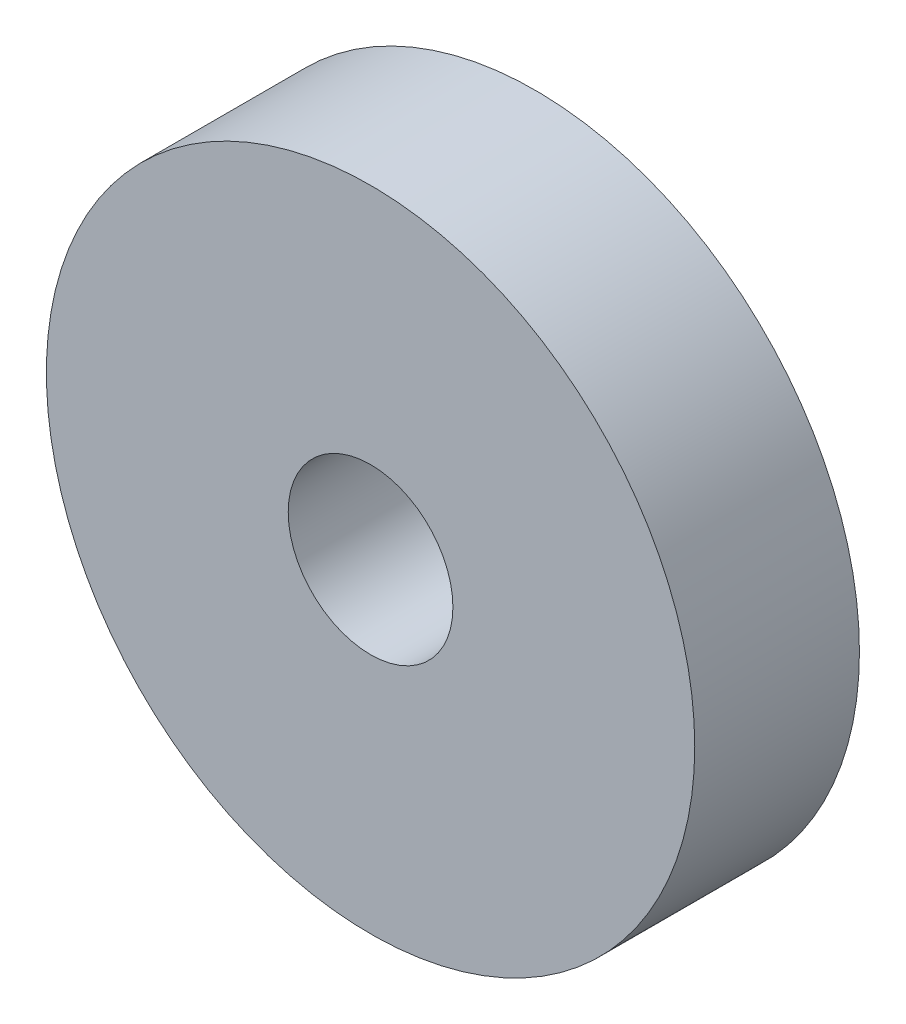
ISO-10303-21;
HEADER;
FILE_DESCRIPTION(('STEP AP214'),'2;1');
FILE_NAME('part.step','',(''),(''),'','','');
FILE_SCHEMA(('AUTOMOTIVE_DESIGN { 1 0 10303 214 1 1 1 1 }'));
ENDSEC;
DATA;
#1=APPLICATION_CONTEXT('core data for automotive mechanical design processes');
#2=APPLICATION_PROTOCOL_DEFINITION('international standard','automotive_design',2000,#1);
#3=PRODUCT_CONTEXT('',#1,'mechanical');
#4=PRODUCT('Part','Part','',(#3));
#5=PRODUCT_RELATED_PRODUCT_CATEGORY('part','',(#4));
#6=PRODUCT_DEFINITION_FORMATION('','',#4);
#7=PRODUCT_DEFINITION_CONTEXT('part definition',#1,'design');
#8=PRODUCT_DEFINITION('design','',#6,#7);
#9=PRODUCT_DEFINITION_SHAPE('','',#8);
#10=(LENGTH_UNIT() NAMED_UNIT(*) SI_UNIT(.MILLI.,.METRE.));
#11=(NAMED_UNIT(*) PLANE_ANGLE_UNIT() SI_UNIT($,.RADIAN.));
#12=(NAMED_UNIT(*) SI_UNIT($,.STERADIAN.) SOLID_ANGLE_UNIT());
#13=UNCERTAINTY_MEASURE_WITH_UNIT(LENGTH_MEASURE(1.E-05),#10,'distance_accuracy_value','');
#14=(GEOMETRIC_REPRESENTATION_CONTEXT(3) GLOBAL_UNCERTAINTY_ASSIGNED_CONTEXT((#13)) GLOBAL_UNIT_ASSIGNED_CONTEXT((#10,
#11,#12)) REPRESENTATION_CONTEXT('',''));
#15=CARTESIAN_POINT('',(0.,0.,0.));
#16=DIRECTION('',(0.,0.,1.));
#17=DIRECTION('',(1.,0.,0.));
#18=AXIS2_PLACEMENT_3D('',#15,#16,#17);
#19=CARTESIAN_POINT('',(0.,0.,6.35));
#20=DIRECTION('',(0.,0.,-1.));
#21=DIRECTION('',(-1.,0.,0.));
#22=AXIS2_PLACEMENT_3D('',#19,#20,#21);
#23=CYLINDRICAL_SURFACE('',#22,12.5);
#24=CARTESIAN_POINT('',(0.,0.,6.35));
#25=DIRECTION('',(0.,0.,1.));
#26=DIRECTION('',(1.,0.,0.));
#27=AXIS2_PLACEMENT_3D('',#24,#25,#26);
#28=CIRCLE('',#27,12.5);
#29=CARTESIAN_POINT('',(12.5,0.,6.35));
#30=VERTEX_POINT('',#29);
#31=EDGE_CURVE('E10',#30,#30,#28,.T.);
#32=ORIENTED_EDGE('',*,*,#31,.F.);
#33=EDGE_LOOP('',(#32));
#34=FACE_BOUND('',#33,.T.);
#35=CARTESIAN_POINT('',(0.,0.,0.));
#36=DIRECTION('',(0.,0.,1.));
#37=DIRECTION('',(1.,0.,0.));
#38=AXIS2_PLACEMENT_3D('',#35,#36,#37);
#39=CIRCLE('',#38,12.5);
#40=CARTESIAN_POINT('',(12.5,0.,0.));
#41=VERTEX_POINT('',#40);
#42=EDGE_CURVE('E38',#41,#41,#39,.T.);
#43=ORIENTED_EDGE('',*,*,#42,.T.);
#44=EDGE_LOOP('',(#43));
#45=FACE_BOUND('',#44,.T.);
#46=ADVANCED_FACE('F31',(#34,#45),#23,.T.);
#47=CARTESIAN_POINT('',(0.,0.,6.35));
#48=DIRECTION('',(0.,0.,1.));
#49=DIRECTION('',(1.,0.,0.));
#50=AXIS2_PLACEMENT_3D('',#47,#48,#49);
#51=PLANE('',#50);
#52=CARTESIAN_POINT('',(0.,0.,6.35));
#53=DIRECTION('',(0.,0.,1.));
#54=DIRECTION('',(1.,0.,0.));
#55=AXIS2_PLACEMENT_3D('',#52,#53,#54);
#56=CIRCLE('',#55,3.17499999999999);
#57=CARTESIAN_POINT('',(3.17499999999999,0.,6.35));
#58=VERTEX_POINT('',#57);
#59=EDGE_CURVE('E34',#58,#58,#56,.T.);
#60=ORIENTED_EDGE('',*,*,#59,.F.);
#61=EDGE_LOOP('',(#60));
#62=FACE_BOUND('',#61,.T.);
#63=ORIENTED_EDGE('',*,*,#31,.T.);
#64=EDGE_LOOP('',(#63));
#65=FACE_BOUND('',#64,.T.);
#66=ADVANCED_FACE('F53',(#62,#65),#51,.T.);
#67=CARTESIAN_POINT('',(0.,0.,0.));
#68=DIRECTION('',(0.,0.,1.));
#69=DIRECTION('',(1.,0.,0.));
#70=AXIS2_PLACEMENT_3D('',#67,#68,#69);
#71=PLANE('',#70);
#72=CARTESIAN_POINT('',(0.,0.,0.));
#73=DIRECTION('',(0.,0.,-1.));
#74=DIRECTION('',(-1.,0.,0.));
#75=AXIS2_PLACEMENT_3D('',#72,#73,#74);
#76=CIRCLE('',#75,3.17499999999999);
#77=CARTESIAN_POINT('',(-3.17499999999999,0.,0.));
#78=VERTEX_POINT('',#77);
#79=EDGE_CURVE('E44',#78,#78,#76,.T.);
#80=ORIENTED_EDGE('',*,*,#79,.F.);
#81=EDGE_LOOP('',(#80));
#82=FACE_BOUND('',#81,.T.);
#83=ORIENTED_EDGE('',*,*,#42,.F.);
#84=EDGE_LOOP('',(#83));
#85=FACE_BOUND('',#84,.T.);
#86=ADVANCED_FACE('F55',(#82,#85),#71,.F.);
#87=CARTESIAN_POINT('',(0.,0.,0.));
#88=DIRECTION('',(0.,0.,-1.));
#89=DIRECTION('',(-1.,0.,0.));
#90=AXIS2_PLACEMENT_3D('',#87,#88,#89);
#91=CYLINDRICAL_SURFACE('',#90,3.17499999999999);
#92=ORIENTED_EDGE('',*,*,#59,.T.);
#93=EDGE_LOOP('',(#92));
#94=FACE_BOUND('',#93,.T.);
#95=ORIENTED_EDGE('',*,*,#79,.T.);
#96=EDGE_LOOP('',(#95));
#97=FACE_BOUND('',#96,.T.);
#98=ADVANCED_FACE('F51',(#94,#97),#91,.F.);
#99=CLOSED_SHELL('',(#46,#66,#86,#98));
#100=MANIFOLD_SOLID_BREP('B2',#99);
#101=ADVANCED_BREP_SHAPE_REPRESENTATION('',(#18,#100),#14);
#102=SHAPE_DEFINITION_REPRESENTATION(#9,#101);
ENDSEC;
END-ISO-10303-21;
